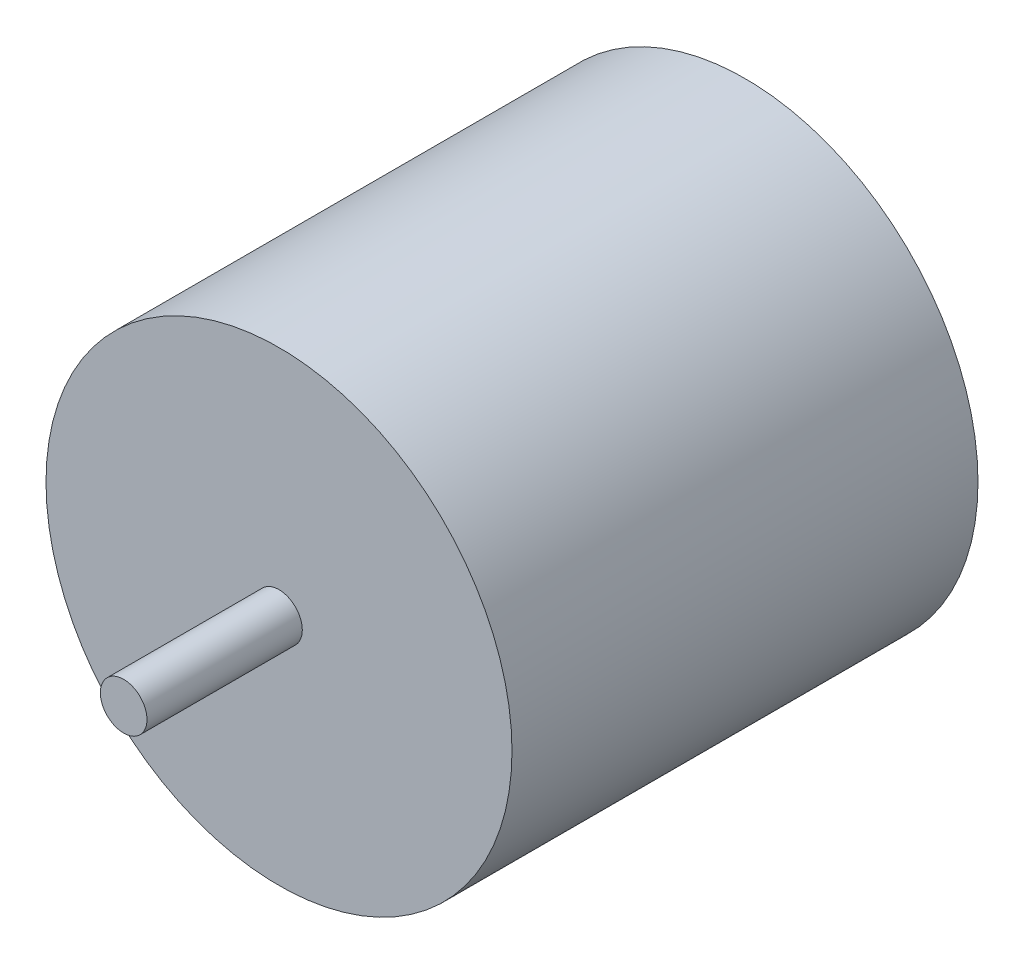
ISO-10303-21;
HEADER;
FILE_DESCRIPTION(('STEP AP214'),'2;1');
FILE_NAME('part.step','',(''),(''),'','','');
FILE_SCHEMA(('AUTOMOTIVE_DESIGN { 1 0 10303 214 1 1 1 1 }'));
ENDSEC;
DATA;
#1=APPLICATION_CONTEXT('core data for automotive mechanical design processes');
#2=APPLICATION_PROTOCOL_DEFINITION('international standard','automotive_design',2000,#1);
#3=PRODUCT_CONTEXT('',#1,'mechanical');
#4=PRODUCT('Part','Part','',(#3));
#5=PRODUCT_RELATED_PRODUCT_CATEGORY('part','',(#4));
#6=PRODUCT_DEFINITION_FORMATION('','',#4);
#7=PRODUCT_DEFINITION_CONTEXT('part definition',#1,'design');
#8=PRODUCT_DEFINITION('design','',#6,#7);
#9=PRODUCT_DEFINITION_SHAPE('','',#8);
#10=(LENGTH_UNIT() NAMED_UNIT(*) SI_UNIT(.MILLI.,.METRE.));
#11=(NAMED_UNIT(*) PLANE_ANGLE_UNIT() SI_UNIT($,.RADIAN.));
#12=(NAMED_UNIT(*) SI_UNIT($,.STERADIAN.) SOLID_ANGLE_UNIT());
#13=UNCERTAINTY_MEASURE_WITH_UNIT(LENGTH_MEASURE(1.E-05),#10,'distance_accuracy_value','');
#14=(GEOMETRIC_REPRESENTATION_CONTEXT(3) GLOBAL_UNCERTAINTY_ASSIGNED_CONTEXT((#13)) GLOBAL_UNIT_ASSIGNED_CONTEXT((#10,
#11,#12)) REPRESENTATION_CONTEXT('',''));
#15=CARTESIAN_POINT('',(0.,0.,0.));
#16=DIRECTION('',(0.,0.,1.));
#17=DIRECTION('',(1.,0.,0.));
#18=AXIS2_PLACEMENT_3D('',#15,#16,#17);
#19=CARTESIAN_POINT('',(0.,0.,0.));
#20=DIRECTION('',(0.,0.,1.));
#21=DIRECTION('',(1.,0.,0.));
#22=AXIS2_PLACEMENT_3D('',#19,#20,#21);
#23=PLANE('',#22);
#24=DIRECTION('',(0.,1.,0.));
#25=VECTOR('',#24,1.);
#26=CARTESIAN_POINT('',(5.,-1.62338657105485,0.));
#27=LINE('',#26,#25);
#28=CARTESIAN_POINT('',(5.,-1.62338657105485,0.));
#29=VERTEX_POINT('',#28);
#30=CARTESIAN_POINT('',(5.,2.37661342894515,0.));
#31=VERTEX_POINT('',#30);
#32=EDGE_CURVE('E125',#29,#31,#27,.T.);
#33=ORIENTED_EDGE('',*,*,#32,.F.);
#34=DIRECTION('',(-1.,0.,0.));
#35=VECTOR('',#34,1.);
#36=CARTESIAN_POINT('',(7.,-1.62338657105485,0.));
#37=LINE('',#36,#35);
#38=CARTESIAN_POINT('',(7.,-1.62338657105485,0.));
#39=VERTEX_POINT('',#38);
#40=EDGE_CURVE('E138',#39,#29,#37,.T.);
#41=ORIENTED_EDGE('',*,*,#40,.F.);
#42=DIRECTION('',(0.,-1.,0.));
#43=VECTOR('',#42,1.);
#44=CARTESIAN_POINT('',(7.,-1.62338657105485,0.));
#45=LINE('',#44,#43);
#46=CARTESIAN_POINT('',(7.,2.37661342894515,0.));
#47=VERTEX_POINT('',#46);
#48=EDGE_CURVE('E147',#47,#39,#45,.T.);
#49=ORIENTED_EDGE('',*,*,#48,.F.);
#50=DIRECTION('',(1.,0.,0.));
#51=VECTOR('',#50,1.);
#52=CARTESIAN_POINT('',(7.,2.37661342894515,0.));
#53=LINE('',#52,#51);
#54=EDGE_CURVE('E128',#31,#47,#53,.T.);
#55=ORIENTED_EDGE('',*,*,#54,.F.);
#56=EDGE_LOOP('',(#33,#41,#49,#55));
#57=FACE_BOUND('',#56,.T.);
#58=CARTESIAN_POINT('',(0.,0.,0.));
#59=DIRECTION('',(0.,0.,1.));
#60=DIRECTION('',(1.,0.,0.));
#61=AXIS2_PLACEMENT_3D('',#58,#59,#60);
#62=CIRCLE('',#61,15.);
#63=CARTESIAN_POINT('',(15.,0.,0.));
#64=VERTEX_POINT('',#63);
#65=EDGE_CURVE('E43',#64,#64,#62,.T.);
#66=ORIENTED_EDGE('',*,*,#65,.F.);
#67=EDGE_LOOP('',(#66));
#68=FACE_BOUND('',#67,.T.);
#69=DIRECTION('',(0.,1.,0.));
#70=VECTOR('',#69,1.);
#71=CARTESIAN_POINT('',(-7.,-1.62338657105485,0.));
#72=LINE('',#71,#70);
#73=CARTESIAN_POINT('',(-7.,-1.62338657105485,0.));
#74=VERTEX_POINT('',#73);
#75=CARTESIAN_POINT('',(-7.,2.37661342894515,0.));
#76=VERTEX_POINT('',#75);
#77=EDGE_CURVE('E124',#74,#76,#72,.T.);
#78=ORIENTED_EDGE('',*,*,#77,.F.);
#79=DIRECTION('',(-1.,0.,0.));
#80=VECTOR('',#79,1.);
#81=CARTESIAN_POINT('',(-7.,-1.62338657105485,0.));
#82=LINE('',#81,#80);
#83=CARTESIAN_POINT('',(-5.,-1.62338657105485,0.));
#84=VERTEX_POINT('',#83);
#85=EDGE_CURVE('E121',#84,#74,#82,.T.);
#86=ORIENTED_EDGE('',*,*,#85,.F.);
#87=DIRECTION('',(0.,-1.,0.));
#88=VECTOR('',#87,1.);
#89=CARTESIAN_POINT('',(-5.,-1.62338657105485,0.));
#90=LINE('',#89,#88);
#91=CARTESIAN_POINT('',(-5.,2.37661342894515,0.));
#92=VERTEX_POINT('',#91);
#93=EDGE_CURVE('E59',#92,#84,#90,.T.);
#94=ORIENTED_EDGE('',*,*,#93,.F.);
#95=DIRECTION('',(1.,0.,0.));
#96=VECTOR('',#95,1.);
#97=CARTESIAN_POINT('',(-7.,2.37661342894515,0.));
#98=LINE('',#97,#96);
#99=EDGE_CURVE('E54',#76,#92,#98,.T.);
#100=ORIENTED_EDGE('',*,*,#99,.F.);
#101=EDGE_LOOP('',(#78,#86,#94,#100));
#102=FACE_BOUND('',#101,.T.);
#103=ADVANCED_FACE('F39',(#57,#68,#102),#23,.F.);
#104=CARTESIAN_POINT('',(0.,0.,30.));
#105=DIRECTION('',(0.,0.,-1.));
#106=DIRECTION('',(-1.,0.,0.));
#107=AXIS2_PLACEMENT_3D('',#104,#105,#106);
#108=CYLINDRICAL_SURFACE('',#107,15.);
#109=CARTESIAN_POINT('',(0.,0.,30.));
#110=DIRECTION('',(0.,0.,1.));
#111=DIRECTION('',(1.,0.,0.));
#112=AXIS2_PLACEMENT_3D('',#109,#110,#111);
#113=CIRCLE('',#112,15.);
#114=CARTESIAN_POINT('',(15.,0.,30.));
#115=VERTEX_POINT('',#114);
#116=EDGE_CURVE('E11',#115,#115,#113,.T.);
#117=ORIENTED_EDGE('',*,*,#116,.F.);
#118=EDGE_LOOP('',(#117));
#119=FACE_BOUND('',#118,.T.);
#120=ORIENTED_EDGE('',*,*,#65,.T.);
#121=EDGE_LOOP('',(#120));
#122=FACE_BOUND('',#121,.T.);
#123=ADVANCED_FACE('F41',(#119,#122),#108,.T.);
#124=CARTESIAN_POINT('',(0.,0.,30.));
#125=DIRECTION('',(0.,0.,1.));
#126=DIRECTION('',(1.,0.,0.));
#127=AXIS2_PLACEMENT_3D('',#124,#125,#126);
#128=PLANE('',#127);
#129=CARTESIAN_POINT('',(0.,0.,30.));
#130=DIRECTION('',(0.,0.,1.));
#131=DIRECTION('',(1.,0.,0.));
#132=AXIS2_PLACEMENT_3D('',#129,#130,#131);
#133=CIRCLE('',#132,1.5);
#134=CARTESIAN_POINT('',(1.5,0.,30.));
#135=VERTEX_POINT('',#134);
#136=EDGE_CURVE('E163',#135,#135,#133,.T.);
#137=ORIENTED_EDGE('',*,*,#136,.F.);
#138=EDGE_LOOP('',(#137));
#139=FACE_BOUND('',#138,.T.);
#140=ORIENTED_EDGE('',*,*,#116,.T.);
#141=EDGE_LOOP('',(#140));
#142=FACE_BOUND('',#141,.T.);
#143=ADVANCED_FACE('F172',(#139,#142),#128,.T.);
#144=CARTESIAN_POINT('',(0.,0.,40.));
#145=DIRECTION('',(0.,0.,-1.));
#146=DIRECTION('',(-1.,0.,0.));
#147=AXIS2_PLACEMENT_3D('',#144,#145,#146);
#148=CYLINDRICAL_SURFACE('',#147,1.5);
#149=CARTESIAN_POINT('',(0.,0.,40.));
#150=DIRECTION('',(0.,0.,1.));
#151=DIRECTION('',(1.,0.,0.));
#152=AXIS2_PLACEMENT_3D('',#149,#150,#151);
#153=CIRCLE('',#152,1.5);
#154=CARTESIAN_POINT('',(1.5,0.,40.));
#155=VERTEX_POINT('',#154);
#156=EDGE_CURVE('E164',#155,#155,#153,.T.);
#157=ORIENTED_EDGE('',*,*,#156,.F.);
#158=EDGE_LOOP('',(#157));
#159=FACE_BOUND('',#158,.T.);
#160=ORIENTED_EDGE('',*,*,#136,.T.);
#161=EDGE_LOOP('',(#160));
#162=FACE_BOUND('',#161,.T.);
#163=ADVANCED_FACE('F170',(#159,#162),#148,.T.);
#164=CARTESIAN_POINT('',(0.,0.,40.));
#165=DIRECTION('',(0.,0.,1.));
#166=DIRECTION('',(1.,0.,0.));
#167=AXIS2_PLACEMENT_3D('',#164,#165,#166);
#168=PLANE('',#167);
#169=ORIENTED_EDGE('',*,*,#156,.T.);
#170=EDGE_LOOP('',(#169));
#171=FACE_BOUND('',#170,.T.);
#172=ADVANCED_FACE('F231',(#171),#168,.T.);
#173=CARTESIAN_POINT('',(5.,-1.62338657105485,-5.));
#174=DIRECTION('',(1.,0.,0.));
#175=DIRECTION('',(0.,0.,-1.));
#176=AXIS2_PLACEMENT_3D('',#173,#174,#175);
#177=PLANE('',#176);
#178=ORIENTED_EDGE('',*,*,#32,.T.);
#179=DIRECTION('',(0.,0.,1.));
#180=VECTOR('',#179,1.);
#181=CARTESIAN_POINT('',(5.,2.37661342894515,-5.));
#182=LINE('',#181,#180);
#183=CARTESIAN_POINT('',(5.,2.37661342894515,-5.));
#184=VERTEX_POINT('',#183);
#185=EDGE_CURVE('E160',#184,#31,#182,.T.);
#186=ORIENTED_EDGE('',*,*,#185,.F.);
#187=DIRECTION('',(0.,1.,0.));
#188=VECTOR('',#187,1.);
#189=CARTESIAN_POINT('',(5.,-1.62338657105485,-5.));
#190=LINE('',#189,#188);
#191=CARTESIAN_POINT('',(5.,-1.62338657105485,-5.));
#192=VERTEX_POINT('',#191);
#193=EDGE_CURVE('E134',#192,#184,#190,.T.);
#194=ORIENTED_EDGE('',*,*,#193,.F.);
#195=DIRECTION('',(0.,0.,1.));
#196=VECTOR('',#195,1.);
#197=CARTESIAN_POINT('',(5.,-1.62338657105485,-5.));
#198=LINE('',#197,#196);
#199=EDGE_CURVE('E143',#192,#29,#198,.T.);
#200=ORIENTED_EDGE('',*,*,#199,.T.);
#201=EDGE_LOOP('',(#178,#186,#194,#200));
#202=FACE_BOUND('',#201,.T.);
#203=ADVANCED_FACE('F227',(#202),#177,.F.);
#204=CARTESIAN_POINT('',(7.,2.37661342894515,-5.));
#205=DIRECTION('',(0.,-1.,0.));
#206=DIRECTION('',(0.,0.,-1.));
#207=AXIS2_PLACEMENT_3D('',#204,#205,#206);
#208=PLANE('',#207);
#209=ORIENTED_EDGE('',*,*,#54,.T.);
#210=DIRECTION('',(0.,0.,1.));
#211=VECTOR('',#210,1.);
#212=CARTESIAN_POINT('',(7.,2.37661342894515,-5.));
#213=LINE('',#212,#211);
#214=CARTESIAN_POINT('',(7.,2.37661342894515,-5.));
#215=VERTEX_POINT('',#214);
#216=EDGE_CURVE('E157',#215,#47,#213,.T.);
#217=ORIENTED_EDGE('',*,*,#216,.F.);
#218=DIRECTION('',(1.,0.,0.));
#219=VECTOR('',#218,1.);
#220=CARTESIAN_POINT('',(7.,2.37661342894515,-5.));
#221=LINE('',#220,#219);
#222=EDGE_CURVE('E137',#184,#215,#221,.T.);
#223=ORIENTED_EDGE('',*,*,#222,.F.);
#224=ORIENTED_EDGE('',*,*,#185,.T.);
#225=EDGE_LOOP('',(#209,#217,#223,#224));
#226=FACE_BOUND('',#225,.T.);
#227=ADVANCED_FACE('F223',(#226),#208,.F.);
#228=CARTESIAN_POINT('',(7.,-1.62338657105485,-5.));
#229=DIRECTION('',(-1.,0.,0.));
#230=DIRECTION('',(0.,0.,1.));
#231=AXIS2_PLACEMENT_3D('',#228,#229,#230);
#232=PLANE('',#231);
#233=ORIENTED_EDGE('',*,*,#48,.T.);
#234=DIRECTION('',(0.,0.,1.));
#235=VECTOR('',#234,1.);
#236=CARTESIAN_POINT('',(7.,-1.62338657105485,-5.));
#237=LINE('',#236,#235);
#238=CARTESIAN_POINT('',(7.,-1.62338657105485,-5.));
#239=VERTEX_POINT('',#238);
#240=EDGE_CURVE('E154',#239,#39,#237,.T.);
#241=ORIENTED_EDGE('',*,*,#240,.F.);
#242=DIRECTION('',(0.,-1.,0.));
#243=VECTOR('',#242,1.);
#244=CARTESIAN_POINT('',(7.,-1.62338657105485,-5.));
#245=LINE('',#244,#243);
#246=EDGE_CURVE('E140',#215,#239,#245,.T.);
#247=ORIENTED_EDGE('',*,*,#246,.F.);
#248=ORIENTED_EDGE('',*,*,#216,.T.);
#249=EDGE_LOOP('',(#233,#241,#247,#248));
#250=FACE_BOUND('',#249,.T.);
#251=ADVANCED_FACE('F219',(#250),#232,.F.);
#252=CARTESIAN_POINT('',(7.,-1.62338657105485,-5.));
#253=DIRECTION('',(0.,1.,0.));
#254=DIRECTION('',(-1.,0.,0.));
#255=AXIS2_PLACEMENT_3D('',#252,#253,#254);
#256=PLANE('',#255);
#257=ORIENTED_EDGE('',*,*,#40,.T.);
#258=ORIENTED_EDGE('',*,*,#199,.F.);
#259=DIRECTION('',(-1.,0.,0.));
#260=VECTOR('',#259,1.);
#261=CARTESIAN_POINT('',(7.,-1.62338657105485,-5.));
#262=LINE('',#261,#260);
#263=EDGE_CURVE('E142',#239,#192,#262,.T.);
#264=ORIENTED_EDGE('',*,*,#263,.F.);
#265=ORIENTED_EDGE('',*,*,#240,.T.);
#266=EDGE_LOOP('',(#257,#258,#264,#265));
#267=FACE_BOUND('',#266,.T.);
#268=ADVANCED_FACE('F215',(#267),#256,.F.);
#269=CARTESIAN_POINT('',(0.,0.,-5.));
#270=DIRECTION('',(0.,0.,1.));
#271=DIRECTION('',(1.,0.,0.));
#272=AXIS2_PLACEMENT_3D('',#269,#270,#271);
#273=PLANE('',#272);
#274=ORIENTED_EDGE('',*,*,#193,.T.);
#275=ORIENTED_EDGE('',*,*,#222,.T.);
#276=ORIENTED_EDGE('',*,*,#246,.T.);
#277=ORIENTED_EDGE('',*,*,#263,.T.);
#278=EDGE_LOOP('',(#274,#275,#276,#277));
#279=FACE_BOUND('',#278,.T.);
#280=ADVANCED_FACE('F212',(#279),#273,.F.);
#281=CARTESIAN_POINT('',(-7.,-1.62338657105485,-5.));
#282=DIRECTION('',(1.,0.,0.));
#283=DIRECTION('',(0.,0.,-1.));
#284=AXIS2_PLACEMENT_3D('',#281,#282,#283);
#285=PLANE('',#284);
#286=ORIENTED_EDGE('',*,*,#77,.T.);
#287=DIRECTION('',(0.,0.,1.));
#288=VECTOR('',#287,1.);
#289=CARTESIAN_POINT('',(-7.,2.37661342894515,-5.));
#290=LINE('',#289,#288);
#291=CARTESIAN_POINT('',(-7.,2.37661342894515,-5.));
#292=VERTEX_POINT('',#291);
#293=EDGE_CURVE('E105',#292,#76,#290,.T.);
#294=ORIENTED_EDGE('',*,*,#293,.F.);
#295=DIRECTION('',(0.,1.,0.));
#296=VECTOR('',#295,1.);
#297=CARTESIAN_POINT('',(-7.,-1.62338657105485,-5.));
#298=LINE('',#297,#296);
#299=CARTESIAN_POINT('',(-7.,-1.62338657105485,-5.));
#300=VERTEX_POINT('',#299);
#301=EDGE_CURVE('E112',#300,#292,#298,.T.);
#302=ORIENTED_EDGE('',*,*,#301,.F.);
#303=DIRECTION('',(0.,0.,1.));
#304=VECTOR('',#303,1.);
#305=CARTESIAN_POINT('',(-7.,-1.62338657105485,-5.));
#306=LINE('',#305,#304);
#307=EDGE_CURVE('E190',#300,#74,#306,.T.);
#308=ORIENTED_EDGE('',*,*,#307,.T.);
#309=EDGE_LOOP('',(#286,#294,#302,#308));
#310=FACE_BOUND('',#309,.T.);
#311=ADVANCED_FACE('F123',(#310),#285,.F.);
#312=CARTESIAN_POINT('',(-7.,2.37661342894515,-5.));
#313=DIRECTION('',(0.,-1.,0.));
#314=DIRECTION('',(0.,0.,-1.));
#315=AXIS2_PLACEMENT_3D('',#312,#313,#314);
#316=PLANE('',#315);
#317=ORIENTED_EDGE('',*,*,#99,.T.);
#318=DIRECTION('',(0.,0.,1.));
#319=VECTOR('',#318,1.);
#320=CARTESIAN_POINT('',(-5.,2.37661342894515,-5.));
#321=LINE('',#320,#319);
#322=CARTESIAN_POINT('',(-5.,2.37661342894515,-5.));
#323=VERTEX_POINT('',#322);
#324=EDGE_CURVE('E108',#323,#92,#321,.T.);
#325=ORIENTED_EDGE('',*,*,#324,.F.);
#326=DIRECTION('',(1.,0.,0.));
#327=VECTOR('',#326,1.);
#328=CARTESIAN_POINT('',(-7.,2.37661342894515,-5.));
#329=LINE('',#328,#327);
#330=EDGE_CURVE('E101',#292,#323,#329,.T.);
#331=ORIENTED_EDGE('',*,*,#330,.F.);
#332=ORIENTED_EDGE('',*,*,#293,.T.);
#333=EDGE_LOOP('',(#317,#325,#331,#332));
#334=FACE_BOUND('',#333,.T.);
#335=ADVANCED_FACE('F103',(#334),#316,.F.);
#336=CARTESIAN_POINT('',(-5.,-1.62338657105485,-5.));
#337=DIRECTION('',(-1.,0.,0.));
#338=DIRECTION('',(0.,0.,1.));
#339=AXIS2_PLACEMENT_3D('',#336,#337,#338);
#340=PLANE('',#339);
#341=ORIENTED_EDGE('',*,*,#93,.T.);
#342=DIRECTION('',(0.,0.,1.));
#343=VECTOR('',#342,1.);
#344=CARTESIAN_POINT('',(-5.,-1.62338657105485,-5.));
#345=LINE('',#344,#343);
#346=CARTESIAN_POINT('',(-5.,-1.62338657105485,-5.));
#347=VERTEX_POINT('',#346);
#348=EDGE_CURVE('E130',#347,#84,#345,.T.);
#349=ORIENTED_EDGE('',*,*,#348,.F.);
#350=DIRECTION('',(0.,-1.,0.));
#351=VECTOR('',#350,1.);
#352=CARTESIAN_POINT('',(-5.,-1.62338657105485,-5.));
#353=LINE('',#352,#351);
#354=EDGE_CURVE('E111',#323,#347,#353,.T.);
#355=ORIENTED_EDGE('',*,*,#354,.F.);
#356=ORIENTED_EDGE('',*,*,#324,.T.);
#357=EDGE_LOOP('',(#341,#349,#355,#356));
#358=FACE_BOUND('',#357,.T.);
#359=ADVANCED_FACE('F199',(#358),#340,.F.);
#360=CARTESIAN_POINT('',(-7.,-1.62338657105485,-5.));
#361=DIRECTION('',(0.,1.,0.));
#362=DIRECTION('',(-1.,0.,0.));
#363=AXIS2_PLACEMENT_3D('',#360,#361,#362);
#364=PLANE('',#363);
#365=ORIENTED_EDGE('',*,*,#85,.T.);
#366=ORIENTED_EDGE('',*,*,#307,.F.);
#367=DIRECTION('',(-1.,0.,0.));
#368=VECTOR('',#367,1.);
#369=CARTESIAN_POINT('',(-7.,-1.62338657105485,-5.));
#370=LINE('',#369,#368);
#371=EDGE_CURVE('E117',#347,#300,#370,.T.);
#372=ORIENTED_EDGE('',*,*,#371,.F.);
#373=ORIENTED_EDGE('',*,*,#348,.T.);
#374=EDGE_LOOP('',(#365,#366,#372,#373));
#375=FACE_BOUND('',#374,.T.);
#376=ADVANCED_FACE('F189',(#375),#364,.F.);
#377=CARTESIAN_POINT('',(0.,0.,-5.));
#378=DIRECTION('',(0.,0.,-1.));
#379=DIRECTION('',(-1.,0.,0.));
#380=AXIS2_PLACEMENT_3D('',#377,#378,#379);
#381=PLANE('',#380);
#382=ORIENTED_EDGE('',*,*,#301,.T.);
#383=ORIENTED_EDGE('',*,*,#330,.T.);
#384=ORIENTED_EDGE('',*,*,#354,.T.);
#385=ORIENTED_EDGE('',*,*,#371,.T.);
#386=EDGE_LOOP('',(#382,#383,#384,#385));
#387=FACE_BOUND('',#386,.T.);
#388=ADVANCED_FACE('F115',(#387),#381,.T.);
#389=CLOSED_SHELL('',(#103,#123,#143,#163,#172,#203,#227,#251,#268,#280,#311,#335,#359,#376,#388));
#390=MANIFOLD_SOLID_BREP('B2',#389);
#391=ADVANCED_BREP_SHAPE_REPRESENTATION('',(#18,#390),#14);
#392=SHAPE_DEFINITION_REPRESENTATION(#9,#391);
ENDSEC;
END-ISO-10303-21;
